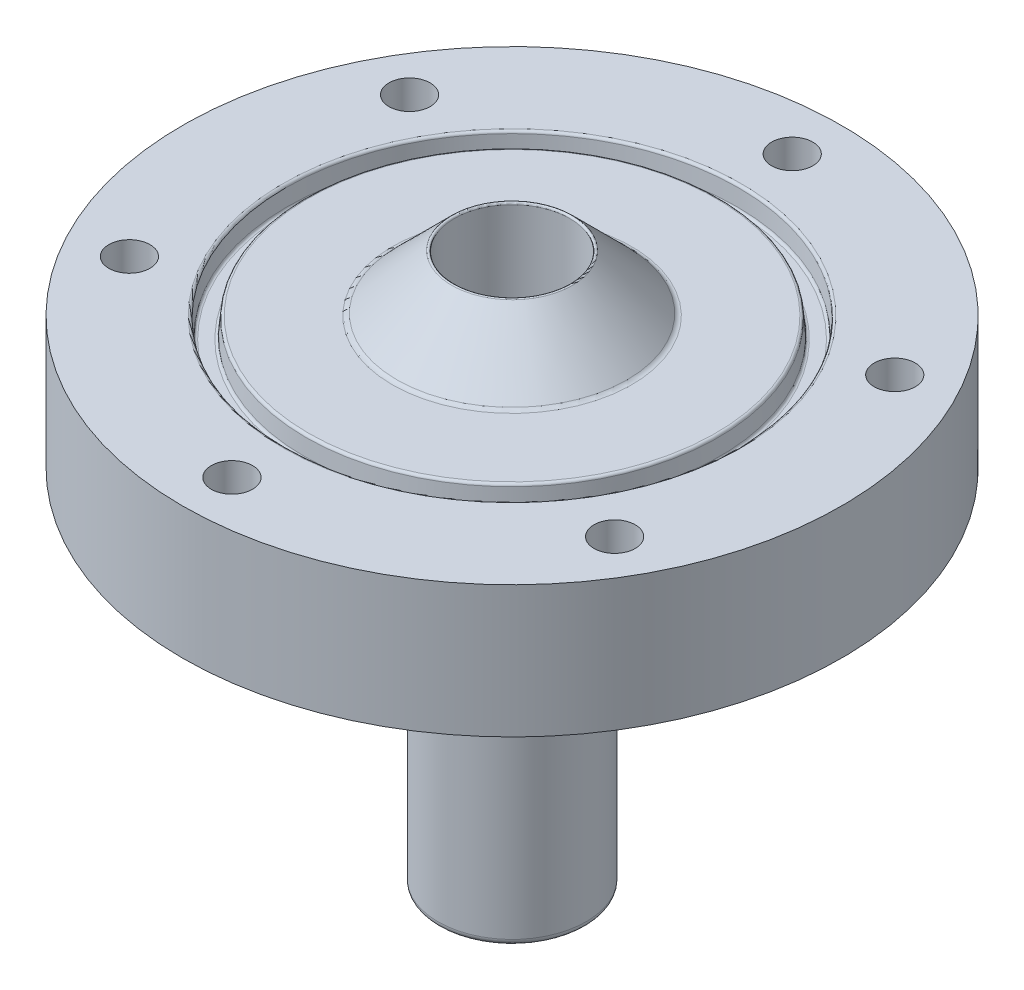
ISO-10303-21;
HEADER;
FILE_DESCRIPTION(('STEP AP214'),'2;1');
FILE_NAME('part.step','',(''),(''),'','','');
FILE_SCHEMA(('AUTOMOTIVE_DESIGN { 1 0 10303 214 1 1 1 1 }'));
ENDSEC;
DATA;
#1=APPLICATION_CONTEXT('core data for automotive mechanical design processes');
#2=APPLICATION_PROTOCOL_DEFINITION('international standard','automotive_design',2000,#1);
#3=PRODUCT_CONTEXT('',#1,'mechanical');
#4=PRODUCT('Part','Part','',(#3));
#5=PRODUCT_RELATED_PRODUCT_CATEGORY('part','',(#4));
#6=PRODUCT_DEFINITION_FORMATION('','',#4);
#7=PRODUCT_DEFINITION_CONTEXT('part definition',#1,'design');
#8=PRODUCT_DEFINITION('design','',#6,#7);
#9=PRODUCT_DEFINITION_SHAPE('','',#8);
#10=(LENGTH_UNIT() NAMED_UNIT(*) SI_UNIT(.MILLI.,.METRE.));
#11=(NAMED_UNIT(*) PLANE_ANGLE_UNIT() SI_UNIT($,.RADIAN.));
#12=(NAMED_UNIT(*) SI_UNIT($,.STERADIAN.) SOLID_ANGLE_UNIT());
#13=UNCERTAINTY_MEASURE_WITH_UNIT(LENGTH_MEASURE(1.E-05),#10,'distance_accuracy_value','');
#14=(GEOMETRIC_REPRESENTATION_CONTEXT(3) GLOBAL_UNCERTAINTY_ASSIGNED_CONTEXT((#13)) GLOBAL_UNIT_ASSIGNED_CONTEXT((#10,
#11,#12)) REPRESENTATION_CONTEXT('',''));
#15=CARTESIAN_POINT('',(0.,0.,0.));
#16=DIRECTION('',(0.,0.,1.));
#17=DIRECTION('',(1.,0.,0.));
#18=AXIS2_PLACEMENT_3D('',#15,#16,#17);
#19=CARTESIAN_POINT('',(0.,9.525,0.));
#20=DIRECTION('',(0.,1.,0.));
#21=DIRECTION('',(0.,0.,1.));
#22=AXIS2_PLACEMENT_3D('',#19,#20,#21);
#23=PLANE('',#22);
#24=CARTESIAN_POINT('',(0.,9.525,0.));
#25=DIRECTION('',(0.,1.,0.));
#26=DIRECTION('',(0.,0.,1.));
#27=AXIS2_PLACEMENT_3D('',#24,#25,#26);
#28=CIRCLE('',#27,9.22740515613755);
#29=CARTESIAN_POINT('',(0.,9.525,9.22740515613755));
#30=VERTEX_POINT('',#29);
#31=EDGE_CURVE('E59',#30,#30,#28,.F.);
#32=ORIENTED_EDGE('',*,*,#31,.T.);
#33=EDGE_LOOP('',(#32));
#34=FACE_BOUND('',#33,.T.);
#35=CARTESIAN_POINT('',(0.,9.525,0.));
#36=DIRECTION('',(0.,1.,0.));
#37=DIRECTION('',(0.,0.,1.));
#38=AXIS2_PLACEMENT_3D('',#35,#36,#37);
#39=CIRCLE('',#38,15.6888015054397);
#40=CARTESIAN_POINT('',(0.,9.525,15.6888015054397));
#41=VERTEX_POINT('',#40);
#42=EDGE_CURVE('E71',#41,#41,#39,.T.);
#43=ORIENTED_EDGE('',*,*,#42,.T.);
#44=EDGE_LOOP('',(#43));
#45=FACE_BOUND('',#44,.T.);
#46=ADVANCED_FACE('F33',(#34,#45),#23,.T.);
#47=CARTESIAN_POINT('',(0.,-0.635000000000004,0.));
#48=DIRECTION('',(0.,1.,0.));
#49=DIRECTION('',(0.,0.,1.));
#50=AXIS2_PLACEMENT_3D('',#47,#48,#49);
#51=PLANE('',#50);
#52=CARTESIAN_POINT('',(0.,-0.635000000000004,0.));
#53=DIRECTION('',(0.,1.,0.));
#54=DIRECTION('',(0.,0.,1.));
#55=AXIS2_PLACEMENT_3D('',#52,#53,#54);
#56=CIRCLE('',#55,6.22299999999999);
#57=CARTESIAN_POINT('',(0.,-0.635000000000004,6.22299999999999));
#58=VERTEX_POINT('',#57);
#59=EDGE_CURVE('E44',#58,#58,#56,.T.);
#60=ORIENTED_EDGE('',*,*,#59,.T.);
#61=EDGE_LOOP('',(#60));
#62=FACE_BOUND('',#61,.T.);
#63=CARTESIAN_POINT('',(18.6974884677063,-0.635000000000004,-10.7950000000005));
#64=DIRECTION('',(0.,1.,0.));
#65=DIRECTION('',(0.,0.,1.));
#66=AXIS2_PLACEMENT_3D('',#63,#64,#65);
#67=CIRCLE('',#66,1.58750000000019);
#68=CARTESIAN_POINT('',(18.6974884677063,-0.635000000000004,-9.20750000000035));
#69=VERTEX_POINT('',#68);
#70=EDGE_CURVE('E104',#69,#69,#67,.F.);
#71=ORIENTED_EDGE('',*,*,#70,.F.);
#72=EDGE_LOOP('',(#71));
#73=FACE_BOUND('',#72,.T.);
#74=CARTESIAN_POINT('',(18.6974884677069,-0.635000000000004,10.7949999999995));
#75=DIRECTION('',(0.,1.,0.));
#76=DIRECTION('',(0.,0.,1.));
#77=AXIS2_PLACEMENT_3D('',#74,#75,#76);
#78=CIRCLE('',#77,1.58750000000082);
#79=CARTESIAN_POINT('',(18.6974884677069,-0.635000000000004,12.3825000000003));
#80=VERTEX_POINT('',#79);
#81=EDGE_CURVE('E124',#80,#80,#78,.F.);
#82=ORIENTED_EDGE('',*,*,#81,.F.);
#83=EDGE_LOOP('',(#82));
#84=FACE_BOUND('',#83,.T.);
#85=CARTESIAN_POINT('',(1.22196138832613E-12,-0.635000000000004,21.59));
#86=DIRECTION('',(0.,1.,0.));
#87=DIRECTION('',(0.,0.,1.));
#88=AXIS2_PLACEMENT_3D('',#85,#86,#87);
#89=CIRCLE('',#88,1.58750000000131);
#90=CARTESIAN_POINT('',(1.22196138832613E-12,-0.635000000000004,23.1775000000013));
#91=VERTEX_POINT('',#90);
#92=EDGE_CURVE('E118',#91,#91,#89,.F.);
#93=ORIENTED_EDGE('',*,*,#92,.F.);
#94=EDGE_LOOP('',(#93));
#95=FACE_BOUND('',#94,.T.);
#96=CARTESIAN_POINT('',(-18.6974884677051,-0.635000000000004,10.7950000000005));
#97=DIRECTION('',(0.,1.,0.));
#98=DIRECTION('',(0.,0.,1.));
#99=AXIS2_PLACEMENT_3D('',#96,#97,#98);
#100=CIRCLE('',#99,1.58750000000123);
#101=CARTESIAN_POINT('',(-18.6974884677051,-0.635000000000004,12.3825000000018));
#102=VERTEX_POINT('',#101);
#103=EDGE_CURVE('E112',#102,#102,#100,.F.);
#104=ORIENTED_EDGE('',*,*,#103,.F.);
#105=EDGE_LOOP('',(#104));
#106=FACE_BOUND('',#105,.T.);
#107=CARTESIAN_POINT('',(-18.6974884677057,-0.635000000000004,-10.7949999999995));
#108=DIRECTION('',(0.,1.,0.));
#109=DIRECTION('',(0.,0.,1.));
#110=AXIS2_PLACEMENT_3D('',#107,#108,#109);
#111=CIRCLE('',#110,1.5875000000007);
#112=CARTESIAN_POINT('',(-18.6974884677057,-0.635000000000004,-9.20749999999875));
#113=VERTEX_POINT('',#112);
#114=EDGE_CURVE('E105',#113,#113,#111,.F.);
#115=ORIENTED_EDGE('',*,*,#114,.F.);
#116=EDGE_LOOP('',(#115));
#117=FACE_BOUND('',#116,.T.);
#118=CARTESIAN_POINT('',(0.,-0.635000000000004,-21.59));
#119=DIRECTION('',(0.,1.,0.));
#120=DIRECTION('',(0.,0.,1.));
#121=AXIS2_PLACEMENT_3D('',#118,#119,#120);
#122=CIRCLE('',#121,1.5875);
#123=CARTESIAN_POINT('',(0.,-0.635000000000004,-20.0025));
#124=VERTEX_POINT('',#123);
#125=EDGE_CURVE('E98',#124,#124,#122,.F.);
#126=ORIENTED_EDGE('',*,*,#125,.F.);
#127=EDGE_LOOP('',(#126));
#128=FACE_BOUND('',#127,.T.);
#129=CARTESIAN_POINT('',(0.,-0.635000000000004,0.));
#130=DIRECTION('',(0.,1.,0.));
#131=DIRECTION('',(0.,0.,1.));
#132=AXIS2_PLACEMENT_3D('',#129,#130,#131);
#133=CIRCLE('',#132,25.4);
#134=CARTESIAN_POINT('',(0.,-0.635000000000004,25.4));
#135=VERTEX_POINT('',#134);
#136=EDGE_CURVE('E95',#135,#135,#133,.T.);
#137=ORIENTED_EDGE('',*,*,#136,.F.);
#138=EDGE_LOOP('',(#137));
#139=FACE_BOUND('',#138,.T.);
#140=ADVANCED_FACE('F169',(#62,#73,#84,#95,#106,#117,#128,#139),#51,.F.);
#141=CARTESIAN_POINT('',(0.,31.1217539611267,0.));
#142=DIRECTION('',(0.,1.,0.));
#143=DIRECTION('',(0.,0.,1.));
#144=AXIS2_PLACEMENT_3D('',#141,#142,#143);
#145=CYLINDRICAL_SURFACE('',#144,5.71499999999999);
#146=CARTESIAN_POINT('',(0.,-28.067,0.));
#147=DIRECTION('',(0.,1.,0.));
#148=DIRECTION('',(0.,0.,1.));
#149=AXIS2_PLACEMENT_3D('',#146,#147,#148);
#150=CIRCLE('',#149,5.71499999999999);
#151=CARTESIAN_POINT('',(0.,-28.067,5.71499999999999));
#152=VERTEX_POINT('',#151);
#153=EDGE_CURVE('E53',#152,#152,#150,.T.);
#154=ORIENTED_EDGE('',*,*,#153,.T.);
#155=EDGE_LOOP('',(#154));
#156=FACE_BOUND('',#155,.T.);
#157=CARTESIAN_POINT('',(0.,-1.14300000000001,0.));
#158=DIRECTION('',(0.,1.,0.));
#159=DIRECTION('',(0.,0.,1.));
#160=AXIS2_PLACEMENT_3D('',#157,#158,#159);
#161=CIRCLE('',#160,5.71499999999999);
#162=CARTESIAN_POINT('',(0.,-1.14300000000001,5.71499999999999));
#163=VERTEX_POINT('',#162);
#164=EDGE_CURVE('E56',#163,#163,#161,.F.);
#165=ORIENTED_EDGE('',*,*,#164,.T.);
#166=EDGE_LOOP('',(#165));
#167=FACE_BOUND('',#166,.T.);
#168=ADVANCED_FACE('F174',(#156,#167),#145,.T.);
#169=CARTESIAN_POINT('',(0.,-28.575,0.));
#170=DIRECTION('',(0.,1.,0.));
#171=DIRECTION('',(0.,0.,1.));
#172=AXIS2_PLACEMENT_3D('',#169,#170,#171);
#173=PLANE('',#172);
#174=CARTESIAN_POINT('',(0.,-28.575,0.));
#175=DIRECTION('',(0.,1.,0.));
#176=DIRECTION('',(0.,0.,1.));
#177=AXIS2_PLACEMENT_3D('',#174,#175,#176);
#178=CIRCLE('',#177,5.20699999999999);
#179=CARTESIAN_POINT('',(0.,-28.575,5.20699999999999));
#180=VERTEX_POINT('',#179);
#181=EDGE_CURVE('E48',#180,#180,#178,.F.);
#182=ORIENTED_EDGE('',*,*,#181,.T.);
#183=EDGE_LOOP('',(#182));
#184=FACE_BOUND('',#183,.T.);
#185=CARTESIAN_POINT('',(0.,-28.575,0.));
#186=DIRECTION('',(0.,1.,0.));
#187=DIRECTION('',(0.,0.,1.));
#188=AXIS2_PLACEMENT_3D('',#185,#186,#187);
#189=CIRCLE('',#188,4.44499999999999);
#190=CARTESIAN_POINT('',(0.,-28.575,4.44499999999999));
#191=VERTEX_POINT('',#190);
#192=EDGE_CURVE('E89',#191,#191,#189,.T.);
#193=ORIENTED_EDGE('',*,*,#192,.T.);
#194=EDGE_LOOP('',(#193));
#195=FACE_BOUND('',#194,.T.);
#196=ADVANCED_FACE('F184',(#184,#195),#173,.F.);
#197=CARTESIAN_POINT('',(0.,31.1217539611267,0.));
#198=DIRECTION('',(0.,1.,0.));
#199=DIRECTION('',(0.,0.,1.));
#200=AXIS2_PLACEMENT_3D('',#197,#198,#199);
#201=CYLINDRICAL_SURFACE('',#200,4.44499999999999);
#202=CARTESIAN_POINT('',(0.,13.7903941260056,0.));
#203=DIRECTION('',(0.,-1.,0.));
#204=DIRECTION('',(0.,0.,-1.));
#205=AXIS2_PLACEMENT_3D('',#202,#203,#204);
#206=CIRCLE('',#205,4.44499999999999);
#207=CARTESIAN_POINT('',(0.,13.7903941260056,-4.44499999999999));
#208=VERTEX_POINT('',#207);
#209=EDGE_CURVE('E40',#208,#208,#206,.F.);
#210=ORIENTED_EDGE('',*,*,#209,.T.);
#211=EDGE_LOOP('',(#210));
#212=FACE_BOUND('',#211,.T.);
#213=ORIENTED_EDGE('',*,*,#192,.F.);
#214=EDGE_LOOP('',(#213));
#215=FACE_BOUND('',#214,.T.);
#216=ADVANCED_FACE('F181',(#212,#215),#201,.F.);
#217=CARTESIAN_POINT('',(0.,14.097,0.));
#218=DIRECTION('',(0.,-1.,0.));
#219=DIRECTION('',(0.,0.,-1.));
#220=AXIS2_PLACEMENT_3D('',#217,#218,#219);
#221=CONICAL_SURFACE('',#220,4.445,0.78539643008897);
#222=CARTESIAN_POINT('',(0.,13.8801965315606,0.));
#223=DIRECTION('',(0.,-1.,0.));
#224=DIRECTION('',(0.,0.,-1.));
#225=AXIS2_PLACEMENT_3D('',#222,#223,#224);
#226=CIRCLE('',#225,4.66180271686609);
#227=CARTESIAN_POINT('',(0.,13.8801965315606,-4.66180271686609));
#228=VERTEX_POINT('',#227);
#229=EDGE_CURVE('E10',#228,#228,#226,.T.);
#230=ORIENTED_EDGE('',*,*,#229,.T.);
#231=EDGE_LOOP('',(#230));
#232=FACE_BOUND('',#231,.T.);
#233=CARTESIAN_POINT('',(0.,9.67379037777993,0.));
#234=DIRECTION('',(0.,-1.,0.));
#235=DIRECTION('',(0.,0.,-1.));
#236=AXIS2_PLACEMENT_3D('',#233,#234,#235);
#237=CIRCLE('',#236,8.86819428867316);
#238=CARTESIAN_POINT('',(0.,9.67379037777993,-8.86819428867316));
#239=VERTEX_POINT('',#238);
#240=EDGE_CURVE('E62',#239,#239,#237,.F.);
#241=ORIENTED_EDGE('',*,*,#240,.T.);
#242=EDGE_LOOP('',(#241));
#243=FACE_BOUND('',#242,.T.);
#244=ADVANCED_FACE('F142',(#232,#243),#221,.T.);
#245=CARTESIAN_POINT('',(18.6974884677063,9.525,-10.7950000000005));
#246=DIRECTION('',(0.,1.,0.));
#247=DIRECTION('',(0.,0.,1.));
#248=AXIS2_PLACEMENT_3D('',#245,#246,#247);
#249=CIRCLE('',#248,1.58750000000019);
#250=CARTESIAN_POINT('',(18.6974884677063,9.525,-9.20750000000035));
#251=VERTEX_POINT('',#250);
#252=EDGE_CURVE('E127',#251,#251,#249,.T.);
#253=ORIENTED_EDGE('',*,*,#252,.F.);
#254=EDGE_LOOP('',(#253));
#255=FACE_BOUND('',#254,.T.);
#256=CARTESIAN_POINT('',(18.6974884677069,9.525,10.7949999999995));
#257=DIRECTION('',(0.,1.,0.));
#258=DIRECTION('',(0.,0.,1.));
#259=AXIS2_PLACEMENT_3D('',#256,#257,#258);
#260=CIRCLE('',#259,1.58750000000082);
#261=CARTESIAN_POINT('',(18.6974884677069,9.525,12.3825000000003));
#262=VERTEX_POINT('',#261);
#263=EDGE_CURVE('E121',#262,#262,#260,.T.);
#264=ORIENTED_EDGE('',*,*,#263,.F.);
#265=EDGE_LOOP('',(#264));
#266=FACE_BOUND('',#265,.T.);
#267=CARTESIAN_POINT('',(1.22196138832613E-12,9.525,21.59));
#268=DIRECTION('',(0.,1.,0.));
#269=DIRECTION('',(0.,0.,1.));
#270=AXIS2_PLACEMENT_3D('',#267,#268,#269);
#271=CIRCLE('',#270,1.58750000000131);
#272=CARTESIAN_POINT('',(1.22196138832613E-12,9.525,23.1775000000013));
#273=VERTEX_POINT('',#272);
#274=EDGE_CURVE('E115',#273,#273,#271,.T.);
#275=ORIENTED_EDGE('',*,*,#274,.F.);
#276=EDGE_LOOP('',(#275));
#277=FACE_BOUND('',#276,.T.);
#278=CARTESIAN_POINT('',(-18.6974884677051,9.525,10.7950000000005));
#279=DIRECTION('',(0.,1.,0.));
#280=DIRECTION('',(0.,0.,1.));
#281=AXIS2_PLACEMENT_3D('',#278,#279,#280);
#282=CIRCLE('',#281,1.58750000000123);
#283=CARTESIAN_POINT('',(-18.6974884677051,9.525,12.3825000000018));
#284=VERTEX_POINT('',#283);
#285=EDGE_CURVE('E108',#284,#284,#282,.T.);
#286=ORIENTED_EDGE('',*,*,#285,.F.);
#287=EDGE_LOOP('',(#286));
#288=FACE_BOUND('',#287,.T.);
#289=CARTESIAN_POINT('',(-18.6974884677057,9.525,-10.7949999999995));
#290=DIRECTION('',(0.,1.,0.));
#291=DIRECTION('',(0.,0.,1.));
#292=AXIS2_PLACEMENT_3D('',#289,#290,#291);
#293=CIRCLE('',#292,1.5875000000007);
#294=CARTESIAN_POINT('',(-18.6974884677057,9.525,-9.20749999999875));
#295=VERTEX_POINT('',#294);
#296=EDGE_CURVE('E109',#295,#295,#293,.T.);
#297=ORIENTED_EDGE('',*,*,#296,.F.);
#298=EDGE_LOOP('',(#297));
#299=FACE_BOUND('',#298,.T.);
#300=CARTESIAN_POINT('',(0.,9.525,-21.59));
#301=DIRECTION('',(0.,1.,0.));
#302=DIRECTION('',(0.,0.,1.));
#303=AXIS2_PLACEMENT_3D('',#300,#301,#302);
#304=CIRCLE('',#303,1.5875);
#305=CARTESIAN_POINT('',(0.,9.525,-20.0025));
#306=VERTEX_POINT('',#305);
#307=EDGE_CURVE('E101',#306,#306,#304,.T.);
#308=ORIENTED_EDGE('',*,*,#307,.F.);
#309=EDGE_LOOP('',(#308));
#310=FACE_BOUND('',#309,.T.);
#311=CARTESIAN_POINT('',(0.,9.525,0.));
#312=DIRECTION('',(0.,1.,0.));
#313=DIRECTION('',(0.,0.,1.));
#314=AXIS2_PLACEMENT_3D('',#311,#312,#313);
#315=CIRCLE('',#314,17.6486984945603);
#316=CARTESIAN_POINT('',(0.,9.525,17.6486984945603));
#317=VERTEX_POINT('',#316);
#318=EDGE_CURVE('E80',#317,#317,#315,.F.);
#319=ORIENTED_EDGE('',*,*,#318,.T.);
#320=EDGE_LOOP('',(#319));
#321=FACE_BOUND('',#320,.T.);
#322=CARTESIAN_POINT('',(0.,9.525,0.));
#323=DIRECTION('',(0.,1.,0.));
#324=DIRECTION('',(0.,0.,1.));
#325=AXIS2_PLACEMENT_3D('',#322,#323,#324);
#326=CIRCLE('',#325,25.4);
#327=CARTESIAN_POINT('',(0.,9.525,25.4));
#328=VERTEX_POINT('',#327);
#329=EDGE_CURVE('E92',#328,#328,#326,.T.);
#330=ORIENTED_EDGE('',*,*,#329,.T.);
#331=EDGE_LOOP('',(#330));
#332=FACE_BOUND('',#331,.T.);
#333=ADVANCED_FACE('F138',(#255,#266,#277,#288,#299,#310,#321,#332),#23,.T.);
#334=CARTESIAN_POINT('',(0.,31.1217539611267,0.));
#335=DIRECTION('',(0.,1.,0.));
#336=DIRECTION('',(0.,0.,1.));
#337=AXIS2_PLACEMENT_3D('',#334,#335,#336);
#338=CYLINDRICAL_SURFACE('',#337,25.4);
#339=ORIENTED_EDGE('',*,*,#136,.T.);
#340=EDGE_LOOP('',(#339));
#341=FACE_BOUND('',#340,.T.);
#342=ORIENTED_EDGE('',*,*,#329,.F.);
#343=EDGE_LOOP('',(#342));
#344=FACE_BOUND('',#343,.T.);
#345=ADVANCED_FACE('F141',(#341,#344),#338,.T.);
#346=CARTESIAN_POINT('',(0.,9.525,0.));
#347=DIRECTION('',(0.,1.,0.));
#348=DIRECTION('',(0.,0.,1.));
#349=AXIS2_PLACEMENT_3D('',#346,#347,#348);
#350=CONICAL_SURFACE('',#349,17.4625,0.0872664625997167);
#351=CARTESIAN_POINT('',(0.,9.33951004692632,0.));
#352=DIRECTION('',(0.,1.,0.));
#353=DIRECTION('',(0.,0.,1.));
#354=AXIS2_PLACEMENT_3D('',#351,#352,#353);
#355=CIRCLE('',#354,17.4462717319081);
#356=CARTESIAN_POINT('',(0.,9.33951004692632,17.4462717319081));
#357=VERTEX_POINT('',#356);
#358=EDGE_CURVE('E83',#357,#357,#355,.T.);
#359=ORIENTED_EDGE('',*,*,#358,.T.);
#360=EDGE_LOOP('',(#359));
#361=FACE_BOUND('',#360,.T.);
#362=CARTESIAN_POINT('',(0.,8.1229899530737,0.));
#363=DIRECTION('',(0.,-1.,0.));
#364=DIRECTION('',(0.,0.,-1.));
#365=AXIS2_PLACEMENT_3D('',#362,#363,#364);
#366=CIRCLE('',#365,17.3398400147445);
#367=CARTESIAN_POINT('',(0.,8.1229899530737,-17.3398400147445));
#368=VERTEX_POINT('',#367);
#369=EDGE_CURVE('E86',#368,#368,#366,.T.);
#370=ORIENTED_EDGE('',*,*,#369,.T.);
#371=EDGE_LOOP('',(#370));
#372=FACE_BOUND('',#371,.T.);
#373=ADVANCED_FACE('F159',(#361,#372),#350,.F.);
#374=CARTESIAN_POINT('',(0.,7.9375,0.));
#375=DIRECTION('',(0.,1.,0.));
#376=DIRECTION('',(0.,0.,1.));
#377=AXIS2_PLACEMENT_3D('',#374,#375,#376);
#378=PLANE('',#377);
#379=CARTESIAN_POINT('',(0.,7.9375,0.));
#380=DIRECTION('',(0.,1.,0.));
#381=DIRECTION('',(0.,0.,1.));
#382=AXIS2_PLACEMENT_3D('',#379,#380,#381);
#383=CIRCLE('',#382,17.1374132520923);
#384=CARTESIAN_POINT('',(0.,7.9375,17.1374132520923));
#385=VERTEX_POINT('',#384);
#386=EDGE_CURVE('E74',#385,#385,#383,.T.);
#387=ORIENTED_EDGE('',*,*,#386,.T.);
#388=EDGE_LOOP('',(#387));
#389=FACE_BOUND('',#388,.T.);
#390=CARTESIAN_POINT('',(0.,7.9375,0.));
#391=DIRECTION('',(0.,1.,0.));
#392=DIRECTION('',(0.,0.,1.));
#393=AXIS2_PLACEMENT_3D('',#390,#391,#392);
#394=CIRCLE('',#393,16.2000867479077);
#395=CARTESIAN_POINT('',(0.,7.9375,16.2000867479077));
#396=VERTEX_POINT('',#395);
#397=EDGE_CURVE('E77',#396,#396,#394,.F.);
#398=ORIENTED_EDGE('',*,*,#397,.T.);
#399=EDGE_LOOP('',(#398));
#400=FACE_BOUND('',#399,.T.);
#401=ADVANCED_FACE('F165',(#389,#400),#378,.T.);
#402=CARTESIAN_POINT('',(0.,9.525,0.));
#403=DIRECTION('',(0.,-1.,0.));
#404=DIRECTION('',(0.,0.,1.));
#405=AXIS2_PLACEMENT_3D('',#402,#403,#404);
#406=CONICAL_SURFACE('',#405,15.875,0.0872664625997167);
#407=CARTESIAN_POINT('',(0.,9.33951004692632,0.));
#408=DIRECTION('',(0.,1.,0.));
#409=DIRECTION('',(0.,0.,1.));
#410=AXIS2_PLACEMENT_3D('',#407,#408,#409);
#411=CIRCLE('',#410,15.8912282680919);
#412=CARTESIAN_POINT('',(0.,9.33951004692632,15.8912282680919));
#413=VERTEX_POINT('',#412);
#414=EDGE_CURVE('E65',#413,#413,#411,.F.);
#415=ORIENTED_EDGE('',*,*,#414,.T.);
#416=EDGE_LOOP('',(#415));
#417=FACE_BOUND('',#416,.T.);
#418=CARTESIAN_POINT('',(0.,8.12298995307367,0.));
#419=DIRECTION('',(0.,-1.,0.));
#420=DIRECTION('',(0.,0.,-1.));
#421=AXIS2_PLACEMENT_3D('',#418,#419,#420);
#422=CIRCLE('',#421,15.9976599852555);
#423=CARTESIAN_POINT('',(0.,8.12298995307367,-15.9976599852555));
#424=VERTEX_POINT('',#423);
#425=EDGE_CURVE('E68',#424,#424,#422,.F.);
#426=ORIENTED_EDGE('',*,*,#425,.T.);
#427=EDGE_LOOP('',(#426));
#428=FACE_BOUND('',#427,.T.);
#429=ADVANCED_FACE('F195',(#417,#428),#406,.T.);
#430=CARTESIAN_POINT('',(0.,9.3218,0.));
#431=DIRECTION('',(0.,1.,0.));
#432=DIRECTION('',(0.,0.,1.));
#433=AXIS2_PLACEMENT_3D('',#430,#431,#432);
#434=TOROIDAL_SURFACE('',#433,17.6486984945603,0.2032);
#435=ORIENTED_EDGE('',*,*,#318,.F.);
#436=EDGE_LOOP('',(#435));
#437=FACE_BOUND('',#436,.T.);
#438=ORIENTED_EDGE('',*,*,#358,.F.);
#439=EDGE_LOOP('',(#438));
#440=FACE_BOUND('',#439,.T.);
#441=ADVANCED_FACE('F191',(#437,#440),#434,.T.);
#442=CARTESIAN_POINT('',(0.,8.1407,0.));
#443=DIRECTION('',(0.,1.,0.));
#444=DIRECTION('',(0.,0.,1.));
#445=AXIS2_PLACEMENT_3D('',#442,#443,#444);
#446=TOROIDAL_SURFACE('',#445,17.1374132520923,0.2032);
#447=ORIENTED_EDGE('',*,*,#369,.F.);
#448=EDGE_LOOP('',(#447));
#449=FACE_BOUND('',#448,.T.);
#450=ORIENTED_EDGE('',*,*,#386,.F.);
#451=EDGE_LOOP('',(#450));
#452=FACE_BOUND('',#451,.T.);
#453=ADVANCED_FACE('F194',(#449,#452),#446,.F.);
#454=CARTESIAN_POINT('',(0.,9.3218,0.));
#455=DIRECTION('',(0.,1.,0.));
#456=DIRECTION('',(0.,0.,1.));
#457=AXIS2_PLACEMENT_3D('',#454,#455,#456);
#458=TOROIDAL_SURFACE('',#457,15.6888015054397,0.2032);
#459=ORIENTED_EDGE('',*,*,#414,.F.);
#460=EDGE_LOOP('',(#459));
#461=FACE_BOUND('',#460,.T.);
#462=ORIENTED_EDGE('',*,*,#42,.F.);
#463=EDGE_LOOP('',(#462));
#464=FACE_BOUND('',#463,.T.);
#465=ADVANCED_FACE('F199',(#461,#464),#458,.T.);
#466=CARTESIAN_POINT('',(0.,8.1407,0.));
#467=DIRECTION('',(0.,1.,0.));
#468=DIRECTION('',(0.,0.,1.));
#469=AXIS2_PLACEMENT_3D('',#466,#467,#468);
#470=TOROIDAL_SURFACE('',#469,16.2000867479077,0.2032);
#471=ORIENTED_EDGE('',*,*,#397,.F.);
#472=EDGE_LOOP('',(#471));
#473=FACE_BOUND('',#472,.T.);
#474=ORIENTED_EDGE('',*,*,#425,.F.);
#475=EDGE_LOOP('',(#474));
#476=FACE_BOUND('',#475,.T.);
#477=ADVANCED_FACE('F203',(#473,#476),#470,.F.);
#478=CARTESIAN_POINT('',(0.,-28.576,-21.59));
#479=DIRECTION('',(0.,1.,0.));
#480=DIRECTION('',(0.,0.,1.));
#481=AXIS2_PLACEMENT_3D('',#478,#479,#480);
#482=CYLINDRICAL_SURFACE('',#481,1.5875);
#483=ORIENTED_EDGE('',*,*,#307,.T.);
#484=EDGE_LOOP('',(#483));
#485=FACE_BOUND('',#484,.T.);
#486=ORIENTED_EDGE('',*,*,#125,.T.);
#487=EDGE_LOOP('',(#486));
#488=FACE_BOUND('',#487,.T.);
#489=ADVANCED_FACE('F207',(#485,#488),#482,.F.);
#490=CARTESIAN_POINT('',(-18.6974884677057,-28.576,-10.7949999999995));
#491=DIRECTION('',(0.,1.,0.));
#492=DIRECTION('',(0.,0.,1.));
#493=AXIS2_PLACEMENT_3D('',#490,#491,#492);
#494=CYLINDRICAL_SURFACE('',#493,1.5875000000007);
#495=ORIENTED_EDGE('',*,*,#296,.T.);
#496=EDGE_LOOP('',(#495));
#497=FACE_BOUND('',#496,.T.);
#498=ORIENTED_EDGE('',*,*,#114,.T.);
#499=EDGE_LOOP('',(#498));
#500=FACE_BOUND('',#499,.T.);
#501=ADVANCED_FACE('F242',(#497,#500),#494,.F.);
#502=CARTESIAN_POINT('',(-18.6974884677051,-28.576,10.7950000000005));
#503=DIRECTION('',(0.,1.,0.));
#504=DIRECTION('',(0.,0.,1.));
#505=AXIS2_PLACEMENT_3D('',#502,#503,#504);
#506=CYLINDRICAL_SURFACE('',#505,1.58750000000123);
#507=ORIENTED_EDGE('',*,*,#285,.T.);
#508=EDGE_LOOP('',(#507));
#509=FACE_BOUND('',#508,.T.);
#510=ORIENTED_EDGE('',*,*,#103,.T.);
#511=EDGE_LOOP('',(#510));
#512=FACE_BOUND('',#511,.T.);
#513=ADVANCED_FACE('F248',(#509,#512),#506,.F.);
#514=CARTESIAN_POINT('',(1.22196138832613E-12,-28.576,21.59));
#515=DIRECTION('',(0.,1.,0.));
#516=DIRECTION('',(0.,0.,1.));
#517=AXIS2_PLACEMENT_3D('',#514,#515,#516);
#518=CYLINDRICAL_SURFACE('',#517,1.58750000000131);
#519=ORIENTED_EDGE('',*,*,#274,.T.);
#520=EDGE_LOOP('',(#519));
#521=FACE_BOUND('',#520,.T.);
#522=ORIENTED_EDGE('',*,*,#92,.T.);
#523=EDGE_LOOP('',(#522));
#524=FACE_BOUND('',#523,.T.);
#525=ADVANCED_FACE('F311',(#521,#524),#518,.F.);
#526=CARTESIAN_POINT('',(18.6974884677069,-28.576,10.7949999999995));
#527=DIRECTION('',(0.,1.,0.));
#528=DIRECTION('',(0.,0.,1.));
#529=AXIS2_PLACEMENT_3D('',#526,#527,#528);
#530=CYLINDRICAL_SURFACE('',#529,1.58750000000082);
#531=ORIENTED_EDGE('',*,*,#263,.T.);
#532=EDGE_LOOP('',(#531));
#533=FACE_BOUND('',#532,.T.);
#534=ORIENTED_EDGE('',*,*,#81,.T.);
#535=EDGE_LOOP('',(#534));
#536=FACE_BOUND('',#535,.T.);
#537=ADVANCED_FACE('F320',(#533,#536),#530,.F.);
#538=CARTESIAN_POINT('',(18.6974884677063,-28.576,-10.7950000000005));
#539=DIRECTION('',(0.,1.,0.));
#540=DIRECTION('',(0.,0.,1.));
#541=AXIS2_PLACEMENT_3D('',#538,#539,#540);
#542=CYLINDRICAL_SURFACE('',#541,1.58750000000019);
#543=ORIENTED_EDGE('',*,*,#252,.T.);
#544=EDGE_LOOP('',(#543));
#545=FACE_BOUND('',#544,.T.);
#546=ORIENTED_EDGE('',*,*,#70,.T.);
#547=EDGE_LOOP('',(#546));
#548=FACE_BOUND('',#547,.T.);
#549=ADVANCED_FACE('F135',(#545,#548),#542,.F.);
#550=CARTESIAN_POINT('',(0.,10.033,0.));
#551=DIRECTION('',(0.,1.,0.));
#552=DIRECTION('',(0.,0.,1.));
#553=AXIS2_PLACEMENT_3D('',#550,#551,#552);
#554=TOROIDAL_SURFACE('',#553,9.22740515613755,0.508);
#555=ORIENTED_EDGE('',*,*,#31,.F.);
#556=EDGE_LOOP('',(#555));
#557=FACE_BOUND('',#556,.T.);
#558=ORIENTED_EDGE('',*,*,#240,.F.);
#559=EDGE_LOOP('',(#558));
#560=FACE_BOUND('',#559,.T.);
#561=ADVANCED_FACE('F209',(#557,#560),#554,.F.);
#562=CARTESIAN_POINT('',(0.,-28.067,0.));
#563=DIRECTION('',(0.,1.,0.));
#564=DIRECTION('',(0.,0.,1.));
#565=AXIS2_PLACEMENT_3D('',#562,#563,#564);
#566=TOROIDAL_SURFACE('',#565,5.20699999999999,0.508);
#567=ORIENTED_EDGE('',*,*,#181,.F.);
#568=EDGE_LOOP('',(#567));
#569=FACE_BOUND('',#568,.T.);
#570=ORIENTED_EDGE('',*,*,#153,.F.);
#571=EDGE_LOOP('',(#570));
#572=FACE_BOUND('',#571,.T.);
#573=ADVANCED_FACE('F212',(#569,#572),#566,.T.);
#574=CARTESIAN_POINT('',(0.,-1.14300000000001,0.));
#575=DIRECTION('',(0.,1.,0.));
#576=DIRECTION('',(0.,0.,1.));
#577=AXIS2_PLACEMENT_3D('',#574,#575,#576);
#578=TOROIDAL_SURFACE('',#577,6.22299999999999,0.508);
#579=ORIENTED_EDGE('',*,*,#164,.F.);
#580=EDGE_LOOP('',(#579));
#581=FACE_BOUND('',#580,.T.);
#582=ORIENTED_EDGE('',*,*,#59,.F.);
#583=EDGE_LOOP('',(#582));
#584=FACE_BOUND('',#583,.T.);
#585=ADVANCED_FACE('F215',(#581,#584),#578,.F.);
#586=CARTESIAN_POINT('',(0.,13.7903941260056,0.));
#587=DIRECTION('',(0.,-1.,0.));
#588=DIRECTION('',(0.,0.,-1.));
#589=AXIS2_PLACEMENT_3D('',#586,#587,#588);
#590=TOROIDAL_SURFACE('',#589,4.572,0.127);
#591=ORIENTED_EDGE('',*,*,#229,.F.);
#592=EDGE_LOOP('',(#591));
#593=FACE_BOUND('',#592,.T.);
#594=ORIENTED_EDGE('',*,*,#209,.F.);
#595=EDGE_LOOP('',(#594));
#596=FACE_BOUND('',#595,.T.);
#597=ADVANCED_FACE('F35',(#593,#596),#590,.T.);
#598=CLOSED_SHELL('',(#46,#140,#168,#196,#216,#244,#333,#345,#373,#401,#429,#441,#453,#465,#477,
#489,#501,#513,#525,#537,#549,#561,#573,#585,#597));
#599=MANIFOLD_SOLID_BREP('B2',#598);
#600=ADVANCED_BREP_SHAPE_REPRESENTATION('',(#18,#599),#14);
#601=SHAPE_DEFINITION_REPRESENTATION(#9,#600);
ENDSEC;
END-ISO-10303-21;
